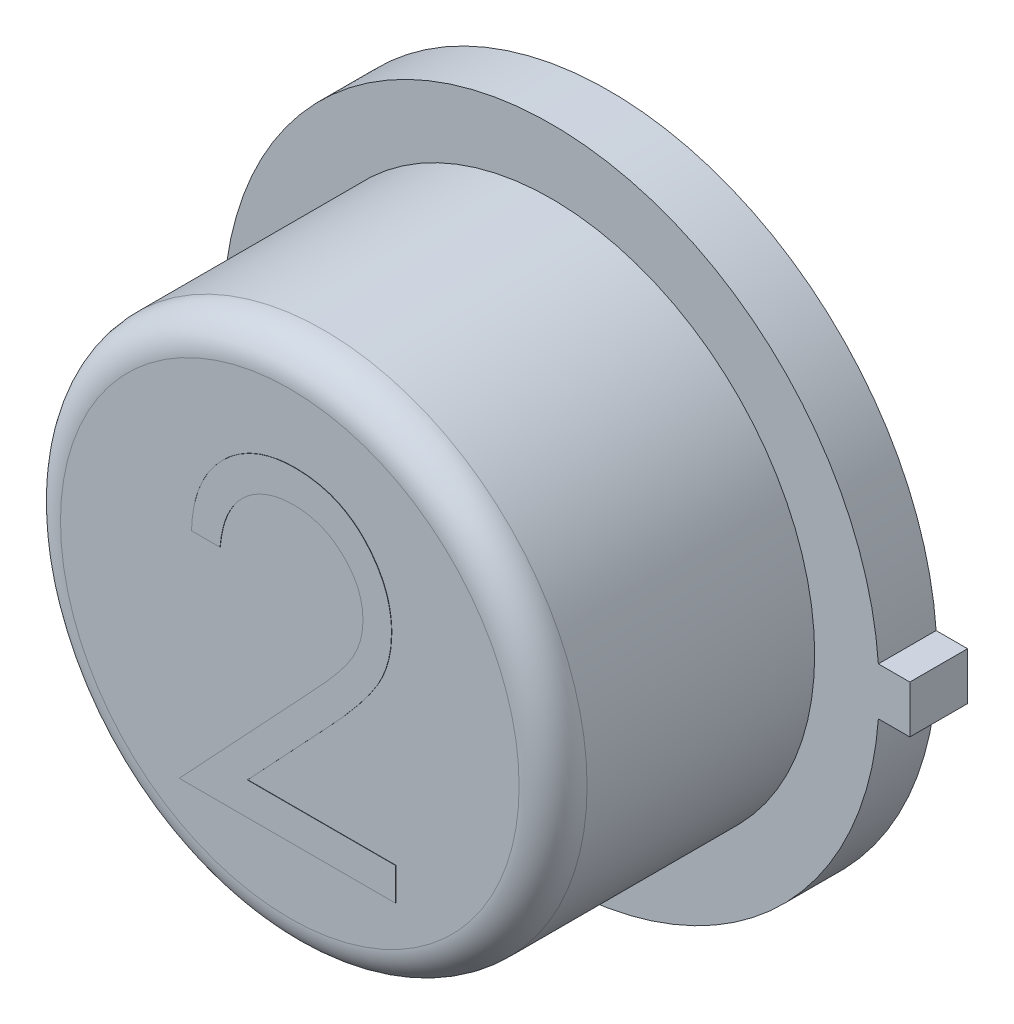
ISO-10303-21;
HEADER;
FILE_DESCRIPTION(('STEP AP214'),'2;1');
FILE_NAME('part.step','',(''),(''),'','','');
FILE_SCHEMA(('AUTOMOTIVE_DESIGN { 1 0 10303 214 1 1 1 1 }'));
ENDSEC;
DATA;
#1=APPLICATION_CONTEXT('core data for automotive mechanical design processes');
#2=APPLICATION_PROTOCOL_DEFINITION('international standard','automotive_design',2000,#1);
#3=PRODUCT_CONTEXT('',#1,'mechanical');
#4=PRODUCT('Part','Part','',(#3));
#5=PRODUCT_RELATED_PRODUCT_CATEGORY('part','',(#4));
#6=PRODUCT_DEFINITION_FORMATION('','',#4);
#7=PRODUCT_DEFINITION_CONTEXT('part definition',#1,'design');
#8=PRODUCT_DEFINITION('design','',#6,#7);
#9=PRODUCT_DEFINITION_SHAPE('','',#8);
#10=(LENGTH_UNIT() NAMED_UNIT(*) SI_UNIT(.MILLI.,.METRE.));
#11=(NAMED_UNIT(*) PLANE_ANGLE_UNIT() SI_UNIT($,.RADIAN.));
#12=(NAMED_UNIT(*) SI_UNIT($,.STERADIAN.) SOLID_ANGLE_UNIT());
#13=UNCERTAINTY_MEASURE_WITH_UNIT(LENGTH_MEASURE(1.E-05),#10,'distance_accuracy_value','');
#14=(GEOMETRIC_REPRESENTATION_CONTEXT(3) GLOBAL_UNCERTAINTY_ASSIGNED_CONTEXT((#13)) GLOBAL_UNIT_ASSIGNED_CONTEXT((#10,
#11,#12)) REPRESENTATION_CONTEXT('',''));
#15=CARTESIAN_POINT('',(0.,0.,0.));
#16=DIRECTION('',(0.,0.,1.));
#17=DIRECTION('',(1.,0.,0.));
#18=AXIS2_PLACEMENT_3D('',#15,#16,#17);
#19=CARTESIAN_POINT('',(-0.00322860507148085,-5.53029106093277,0.));
#20=DIRECTION('',(0.,0.,1.));
#21=DIRECTION('',(1.,0.,0.));
#22=AXIS2_PLACEMENT_3D('',#19,#20,#21);
#23=PLANE('',#22);
#24=DIRECTION('',(1.,0.,0.));
#25=VECTOR('',#24,1.);
#26=CARTESIAN_POINT('',(-0.0032286050714822,0.177799999999999,0.));
#27=LINE('',#26,#25);
#28=CARTESIAN_POINT('',(2.44464278985704,0.177799999999999,0.));
#29=VERTEX_POINT('',#28);
#30=CARTESIAN_POINT('',(2.6797,0.177799999999999,0.));
#31=VERTEX_POINT('',#30);
#32=EDGE_CURVE('E226',#29,#31,#27,.T.);
#33=ORIENTED_EDGE('',*,*,#32,.T.);
#34=DIRECTION('',(0.,-1.,0.));
#35=VECTOR('',#34,1.);
#36=CARTESIAN_POINT('',(2.6797,-5.53029106093277,0.));
#37=LINE('',#36,#35);
#38=CARTESIAN_POINT('',(2.6797,-0.1778,0.));
#39=VERTEX_POINT('',#38);
#40=EDGE_CURVE('E249',#31,#39,#37,.T.);
#41=ORIENTED_EDGE('',*,*,#40,.T.);
#42=DIRECTION('',(-1.,0.,0.));
#43=VECTOR('',#42,1.);
#44=CARTESIAN_POINT('',(-0.00322860507148085,-0.1778,0.));
#45=LINE('',#44,#43);
#46=CARTESIAN_POINT('',(2.44464278985704,-0.1778,0.));
#47=VERTEX_POINT('',#46);
#48=EDGE_CURVE('E238',#39,#47,#45,.T.);
#49=ORIENTED_EDGE('',*,*,#48,.T.);
#50=CARTESIAN_POINT('',(0.,0.,0.));
#51=DIRECTION('',(0.,0.,1.));
#52=DIRECTION('',(1.,0.,0.));
#53=AXIS2_PLACEMENT_3D('',#50,#51,#52);
#54=CIRCLE('',#53,2.4511);
#55=EDGE_CURVE('E234',#29,#47,#54,.T.);
#56=ORIENTED_EDGE('',*,*,#55,.F.);
#57=EDGE_LOOP('',(#33,#41,#49,#56));
#58=FACE_BOUND('',#57,.T.);
#59=CARTESIAN_POINT('',(0.,0.,0.));
#60=DIRECTION('',(0.,0.,1.));
#61=DIRECTION('',(1.,0.,0.));
#62=AXIS2_PLACEMENT_3D('',#59,#60,#61);
#63=CIRCLE('',#62,1.75756648099992);
#64=CARTESIAN_POINT('',(1.75756648099992,0.,0.));
#65=VERTEX_POINT('',#64);
#66=EDGE_CURVE('E258',#65,#65,#63,.F.);
#67=ORIENTED_EDGE('',*,*,#66,.F.);
#68=EDGE_LOOP('',(#67));
#69=FACE_BOUND('',#68,.T.);
#70=ADVANCED_FACE('F33',(#58,#69),#23,.F.);
#71=CARTESIAN_POINT('',(-0.00322860507148085,-5.53029106093277,0.4318));
#72=DIRECTION('',(0.,0.,1.));
#73=DIRECTION('',(1.,0.,0.));
#74=AXIS2_PLACEMENT_3D('',#71,#72,#73);
#75=PLANE('',#74);
#76=DIRECTION('',(1.,0.,0.));
#77=VECTOR('',#76,1.);
#78=CARTESIAN_POINT('',(-0.0032286050714822,0.177799999999999,0.4318));
#79=LINE('',#78,#77);
#80=CARTESIAN_POINT('',(2.44464278985704,0.177799999999999,0.4318));
#81=VERTEX_POINT('',#80);
#82=CARTESIAN_POINT('',(2.6797,0.177799999999999,0.4318));
#83=VERTEX_POINT('',#82);
#84=EDGE_CURVE('E251',#81,#83,#79,.T.);
#85=ORIENTED_EDGE('',*,*,#84,.F.);
#86=CARTESIAN_POINT('',(0.,0.,0.4318));
#87=DIRECTION('',(0.,0.,1.));
#88=DIRECTION('',(1.,0.,0.));
#89=AXIS2_PLACEMENT_3D('',#86,#87,#88);
#90=CIRCLE('',#89,2.4511);
#91=CARTESIAN_POINT('',(2.44464278985704,-0.1778,0.4318));
#92=VERTEX_POINT('',#91);
#93=EDGE_CURVE('E560',#81,#92,#90,.T.);
#94=ORIENTED_EDGE('',*,*,#93,.T.);
#95=DIRECTION('',(-1.,0.,0.));
#96=VECTOR('',#95,1.);
#97=CARTESIAN_POINT('',(-0.00322860507148085,-0.1778,0.4318));
#98=LINE('',#97,#96);
#99=CARTESIAN_POINT('',(2.6797,-0.1778,0.4318));
#100=VERTEX_POINT('',#99);
#101=EDGE_CURVE('E561',#100,#92,#98,.T.);
#102=ORIENTED_EDGE('',*,*,#101,.F.);
#103=DIRECTION('',(0.,-1.,0.));
#104=VECTOR('',#103,1.);
#105=CARTESIAN_POINT('',(2.6797,-5.53029106093277,0.4318));
#106=LINE('',#105,#104);
#107=EDGE_CURVE('E244',#83,#100,#106,.T.);
#108=ORIENTED_EDGE('',*,*,#107,.F.);
#109=EDGE_LOOP('',(#85,#94,#102,#108));
#110=FACE_BOUND('',#109,.T.);
#111=CARTESIAN_POINT('',(0.,0.,0.4318));
#112=DIRECTION('',(0.,0.,1.));
#113=DIRECTION('',(1.,0.,0.));
#114=AXIS2_PLACEMENT_3D('',#111,#112,#113);
#115=CIRCLE('',#114,1.9685);
#116=CARTESIAN_POINT('',(1.9685,0.,0.4318));
#117=VERTEX_POINT('',#116);
#118=EDGE_CURVE('E235',#117,#117,#115,.T.);
#119=ORIENTED_EDGE('',*,*,#118,.F.);
#120=EDGE_LOOP('',(#119));
#121=FACE_BOUND('',#120,.T.);
#122=ADVANCED_FACE('F202',(#110,#121),#75,.T.);
#123=CARTESIAN_POINT('',(-0.0032286050714822,0.177799999999999,0.4318));
#124=DIRECTION('',(0.,1.,0.));
#125=DIRECTION('',(-1.,0.,0.));
#126=AXIS2_PLACEMENT_3D('',#123,#124,#125);
#127=PLANE('',#126);
#128=ORIENTED_EDGE('',*,*,#32,.F.);
#129=DIRECTION('',(0.,0.,-1.));
#130=VECTOR('',#129,1.);
#131=CARTESIAN_POINT('',(2.44464278985704,0.177799999999999,0.4318));
#132=LINE('',#131,#130);
#133=EDGE_CURVE('E228',#81,#29,#132,.T.);
#134=ORIENTED_EDGE('',*,*,#133,.F.);
#135=ORIENTED_EDGE('',*,*,#84,.T.);
#136=DIRECTION('',(0.,0.,-1.));
#137=VECTOR('',#136,1.);
#138=CARTESIAN_POINT('',(2.6797,0.177799999999999,0.4318));
#139=LINE('',#138,#137);
#140=EDGE_CURVE('E230',#83,#31,#139,.T.);
#141=ORIENTED_EDGE('',*,*,#140,.T.);
#142=EDGE_LOOP('',(#128,#134,#135,#141));
#143=FACE_BOUND('',#142,.T.);
#144=ADVANCED_FACE('F205',(#143),#127,.T.);
#145=CARTESIAN_POINT('',(0.,0.,0.4318));
#146=DIRECTION('',(0.,0.,-1.));
#147=DIRECTION('',(-1.,0.,0.));
#148=AXIS2_PLACEMENT_3D('',#145,#146,#147);
#149=CYLINDRICAL_SURFACE('',#148,2.4511);
#150=ORIENTED_EDGE('',*,*,#55,.T.);
#151=DIRECTION('',(0.,0.,-1.));
#152=VECTOR('',#151,1.);
#153=CARTESIAN_POINT('',(2.44464278985704,-0.1778,0.4318));
#154=LINE('',#153,#152);
#155=EDGE_CURVE('E255',#92,#47,#154,.T.);
#156=ORIENTED_EDGE('',*,*,#155,.F.);
#157=ORIENTED_EDGE('',*,*,#93,.F.);
#158=ORIENTED_EDGE('',*,*,#133,.T.);
#159=EDGE_LOOP('',(#150,#156,#157,#158));
#160=FACE_BOUND('',#159,.T.);
#161=ADVANCED_FACE('F216',(#160),#149,.T.);
#162=CARTESIAN_POINT('',(-0.00322860507148085,-0.1778,0.4318));
#163=DIRECTION('',(0.,-1.,0.));
#164=DIRECTION('',(0.,0.,-1.));
#165=AXIS2_PLACEMENT_3D('',#162,#163,#164);
#166=PLANE('',#165);
#167=ORIENTED_EDGE('',*,*,#48,.F.);
#168=DIRECTION('',(0.,0.,-1.));
#169=VECTOR('',#168,1.);
#170=CARTESIAN_POINT('',(2.6797,-0.1778,0.4318));
#171=LINE('',#170,#169);
#172=EDGE_CURVE('E253',#100,#39,#171,.T.);
#173=ORIENTED_EDGE('',*,*,#172,.F.);
#174=ORIENTED_EDGE('',*,*,#101,.T.);
#175=ORIENTED_EDGE('',*,*,#155,.T.);
#176=EDGE_LOOP('',(#167,#173,#174,#175));
#177=FACE_BOUND('',#176,.T.);
#178=ADVANCED_FACE('F212',(#177),#166,.T.);
#179=CARTESIAN_POINT('',(2.6797,-5.53029106093277,0.4318));
#180=DIRECTION('',(1.,0.,0.));
#181=DIRECTION('',(0.,0.,-1.));
#182=AXIS2_PLACEMENT_3D('',#179,#180,#181);
#183=PLANE('',#182);
#184=ORIENTED_EDGE('',*,*,#40,.F.);
#185=ORIENTED_EDGE('',*,*,#140,.F.);
#186=ORIENTED_EDGE('',*,*,#107,.T.);
#187=ORIENTED_EDGE('',*,*,#172,.T.);
#188=EDGE_LOOP('',(#184,#185,#186,#187));
#189=FACE_BOUND('',#188,.T.);
#190=ADVANCED_FACE('F200',(#189),#183,.T.);
#191=CARTESIAN_POINT('',(0.,0.,2.3876));
#192=DIRECTION('',(0.,0.,-1.));
#193=DIRECTION('',(-1.,0.,0.));
#194=AXIS2_PLACEMENT_3D('',#191,#192,#193);
#195=CYLINDRICAL_SURFACE('',#194,1.9685);
#196=CARTESIAN_POINT('',(0.,0.,2.1336));
#197=DIRECTION('',(0.,0.,1.));
#198=DIRECTION('',(1.,0.,0.));
#199=AXIS2_PLACEMENT_3D('',#196,#197,#198);
#200=CIRCLE('',#199,1.9685);
#201=CARTESIAN_POINT('',(1.9685,0.,2.1336));
#202=VERTEX_POINT('',#201);
#203=EDGE_CURVE('E11',#202,#202,#200,.F.);
#204=ORIENTED_EDGE('',*,*,#203,.T.);
#205=EDGE_LOOP('',(#204));
#206=FACE_BOUND('',#205,.T.);
#207=ORIENTED_EDGE('',*,*,#118,.T.);
#208=EDGE_LOOP('',(#207));
#209=FACE_BOUND('',#208,.T.);
#210=ADVANCED_FACE('F197',(#206,#209),#195,.T.);
#211=CARTESIAN_POINT('',(0.,0.,2.3876));
#212=DIRECTION('',(0.,0.,1.));
#213=DIRECTION('',(1.,0.,0.));
#214=AXIS2_PLACEMENT_3D('',#211,#212,#213);
#215=PLANE('',#214);
#216=CARTESIAN_POINT('',(0.0329139122596155,0.979935716155492,2.3876));
#217=CARTESIAN_POINT('',(0.0142919706879015,0.979449238847353,2.3876));
#218=CARTESIAN_POINT('',(-0.0222784478114771,0.978493877738492,2.3876));
#219=CARTESIAN_POINT('',(-0.0759715755772296,0.97181095812963,2.3876));
#220=CARTESIAN_POINT('',(-0.127192792071144,0.960281734573859,2.3876));
#221=CARTESIAN_POINT('',(-0.17607094390161,0.944513318606976,2.3876));
#222=CARTESIAN_POINT('',(-0.222688733534912,0.924470984497503,2.3876));
#223=CARTESIAN_POINT('',(-0.266819449210305,0.89950749392141,2.3876));
#224=CARTESIAN_POINT('',(-0.308364022081785,0.869719081615842,2.3876));
#225=CARTESIAN_POINT('',(-0.3474005495722,0.835945774545375,2.3876));
#226=CARTESIAN_POINT('',(-0.383366935327934,0.798344067289539,2.3876));
#227=CARTESIAN_POINT('',(-0.41496739908603,0.756427288845778,2.3876));
#228=CARTESIAN_POINT('',(-0.442579022994465,0.710960779459374,2.3876));
#229=CARTESIAN_POINT('',(-0.466669947915542,0.662067219161298,2.3876));
#230=CARTESIAN_POINT('',(-0.486234087061141,0.609302950993265,2.3876));
#231=CARTESIAN_POINT('',(-0.501183676908015,0.55285528037316,2.3876));
#232=CARTESIAN_POINT('',(-0.513012942266827,0.49296930478729,2.3876));
#233=CARTESIAN_POINT('',(-0.51696481074977,0.451613738125944,2.3876));
#234=CARTESIAN_POINT('',(-0.518990384615384,0.430416485386261,2.3876));
#235=B_SPLINE_CURVE_WITH_KNOTS('',3,(#216,#217,#218,#219,#220,#221,#222,#223,#224,#225,#226,
#227,#228,#229,#230,#231,#232,#233,#234),.UNSPECIFIED.,.F.,.F.,(4,1,1,1,1,1,1,1,1,1,1,1,1,1,1,1,
4),(0.,0.0644386715952429,0.126546911271678,0.18688715343657,0.245877535589455,
0.304040884691267,0.36219121807266,0.420975932791644,0.480660283279666,0.540600274953758,
0.600689098349454,0.661935789757196,0.724442505913983,0.789038393881744,0.856313757050995,
0.926352028205864,1.),.UNSPECIFIED.);
#236=CARTESIAN_POINT('',(0.0329139122596155,0.979935716155492,2.3876));
#237=VERTEX_POINT('',#236);
#238=CARTESIAN_POINT('',(-0.518990384615384,0.430416485386261,2.3876));
#239=VERTEX_POINT('',#238);
#240=EDGE_CURVE('E476',#237,#239,#235,.T.);
#241=ORIENTED_EDGE('',*,*,#240,.T.);
#242=DIRECTION('',(-1.,0.,0.));
#243=VECTOR('',#242,1.);
#244=CARTESIAN_POINT('',(-0.518990384615384,0.430416485386261,2.3876));
#245=LINE('',#244,#243);
#246=CARTESIAN_POINT('',(-0.732692307692307,0.430416485386261,2.3876));
#247=VERTEX_POINT('',#246);
#248=EDGE_CURVE('E151',#239,#247,#245,.T.);
#249=ORIENTED_EDGE('',*,*,#248,.T.);
#250=CARTESIAN_POINT('',(-0.732692307692307,0.430416485386261,2.3876));
#251=CARTESIAN_POINT('',(-0.731299512520841,0.45876757152828,2.3876));
#252=CARTESIAN_POINT('',(-0.728564099870997,0.51444835019442,2.3876));
#253=CARTESIAN_POINT('',(-0.715754138783993,0.595631222226658,2.3876));
#254=CARTESIAN_POINT('',(-0.697424720542823,0.673229219216252,2.3876));
#255=CARTESIAN_POINT('',(-0.671508927722036,0.746619285684894,2.3876));
#256=CARTESIAN_POINT('',(-0.63932376373939,0.816450331318382,2.3876));
#257=CARTESIAN_POINT('',(-0.60072708439632,0.882444984851201,2.3876));
#258=CARTESIAN_POINT('',(-0.555011268243438,0.944351490030246,2.3876));
#259=CARTESIAN_POINT('',(-0.503163472401816,1.00159595305806,2.3876));
#260=CARTESIAN_POINT('',(-0.44685123761618,1.05411106819117,2.3876));
#261=CARTESIAN_POINT('',(-0.386091303797491,1.09946043874323,2.3876));
#262=CARTESIAN_POINT('',(-0.32224316916163,1.13777656872343,2.3876));
#263=CARTESIAN_POINT('',(-0.255500542365531,1.16980862789286,2.3876));
#264=CARTESIAN_POINT('',(-0.185110408943832,1.19385234449373,2.3876));
#265=CARTESIAN_POINT('',(-0.111711536020924,1.21169242429614,2.3876));
#266=CARTESIAN_POINT('',(-0.0349814449995035,1.222425973796,2.3876));
#267=CARTESIAN_POINT('',(0.0172972128574278,1.22357971364463,2.3876));
#268=CARTESIAN_POINT('',(0.0438852163461539,1.22416648538626,2.3876));
#269=B_SPLINE_CURVE_WITH_KNOTS('',3,(#250,#251,#252,#253,#254,#255,#256,#257,#258,#259,#260,
#261,#262,#263,#264,#265,#266,#267,#268),.UNSPECIFIED.,.F.,.F.,(4,1,1,1,1,1,1,1,1,1,1,1,1,1,1,1,
4),(0.,0.0687907943906179,0.135103289431128,0.198978674310651,0.261904299780856,
0.323494969367969,0.385195377966051,0.446969238740774,0.509764776703132,0.572250568847368,
0.633405175661153,0.693251162921752,0.75258316278567,0.812579266153421,0.873275084920192,
0.935549942895029,1.),.UNSPECIFIED.);
#270=CARTESIAN_POINT('',(0.0438852163461539,1.22416648538626,2.3876));
#271=VERTEX_POINT('',#270);
#272=EDGE_CURVE('E487',#247,#271,#269,.T.);
#273=ORIENTED_EDGE('',*,*,#272,.T.);
#274=CARTESIAN_POINT('',(0.0438852163461539,1.22416648538626,2.3876));
#275=CARTESIAN_POINT('',(0.0699960131805783,1.22355521412607,2.3876));
#276=CARTESIAN_POINT('',(0.121302796241458,1.22235408793536,2.3876));
#277=CARTESIAN_POINT('',(0.196184273931725,1.21203917338033,2.3876));
#278=CARTESIAN_POINT('',(0.267470254629134,1.1958836904999,2.3876));
#279=CARTESIAN_POINT('',(0.335021395780641,1.17321730904389,2.3876));
#280=CARTESIAN_POINT('',(0.398298736140724,1.14274790397861,2.3876));
#281=CARTESIAN_POINT('',(0.457777628954953,1.10614636428441,2.3876));
#282=CARTESIAN_POINT('',(0.514166180582402,1.06381465758299,2.3876));
#283=CARTESIAN_POINT('',(0.564925438718533,1.01397590236185,2.3876));
#284=CARTESIAN_POINT('',(0.611535399770343,0.960770351498978,2.3876));
#285=CARTESIAN_POINT('',(0.651746041216715,0.903968759934283,2.3876));
#286=CARTESIAN_POINT('',(0.686181068508389,0.845302049474601,2.3876));
#287=CARTESIAN_POINT('',(0.71488375785612,0.78432286232718,2.3876));
#288=CARTESIAN_POINT('',(0.736013023812921,0.720457037639259,2.3876));
#289=CARTESIAN_POINT('',(0.752054626061474,0.654634387168514,2.3876));
#290=CARTESIAN_POINT('',(0.76112202715998,0.586173578251548,2.3876));
#291=CARTESIAN_POINT('',(0.762513645646911,0.539836796641207,2.3876));
#292=CARTESIAN_POINT('',(0.763221153846154,0.516278865193954,2.3876));
#293=B_SPLINE_CURVE_WITH_KNOTS('',3,(#274,#275,#276,#277,#278,#279,#280,#281,#282,#283,#284,
#285,#286,#287,#288,#289,#290,#291,#292),.UNSPECIFIED.,.F.,.F.,(4,1,1,1,1,1,1,1,1,1,1,1,1,1,1,1,
4),(0.,0.0694754602496704,0.136516797617799,0.200788823609261,0.263829672855826,
0.32573502296542,0.387290692215291,0.449509218762603,0.512967819545441,0.576275215493061,
0.637580100263924,0.697902605917102,0.757172088426985,0.816598528488655,0.87665317089282,
0.93728964241024,1.),.UNSPECIFIED.);
#294=CARTESIAN_POINT('',(0.763221153846154,0.516278865193954,2.3876));
#295=VERTEX_POINT('',#294);
#296=EDGE_CURVE('E491',#271,#295,#293,.T.);
#297=ORIENTED_EDGE('',*,*,#296,.T.);
#298=CARTESIAN_POINT('',(0.763221153846154,0.516278865193954,2.3876));
#299=CARTESIAN_POINT('',(0.762069130367012,0.483112927742152,2.3876));
#300=CARTESIAN_POINT('',(0.759785299789741,0.417363068084171,2.3876));
#301=CARTESIAN_POINT('',(0.74024926858941,0.320742241820885,2.3876));
#302=CARTESIAN_POINT('',(0.709737624433396,0.22712957633513,2.3876));
#303=CARTESIAN_POINT('',(0.673000137005537,0.151788661881248,2.3876));
#304=CARTESIAN_POINT('',(0.635939420599286,0.0910780170215541,2.3876));
#305=CARTESIAN_POINT('',(0.602542384182895,0.0410930588529433,2.3876));
#306=CARTESIAN_POINT('',(0.563445789541273,-0.0127269116048438,2.3876));
#307=CARTESIAN_POINT('',(0.518080597177372,-0.0702016714967657,2.3876));
#308=CARTESIAN_POINT('',(0.467385232374817,-0.131781412287035,2.3876));
#309=CARTESIAN_POINT('',(0.410900510519678,-0.197428933799167,2.3876));
#310=CARTESIAN_POINT('',(0.348223641501548,-0.266465977194596,2.3876));
#311=CARTESIAN_POINT('',(0.304232768666899,-0.313618538138815,2.3876));
#312=CARTESIAN_POINT('',(0.281437800480769,-0.338051813892585,2.3876));
#313=B_SPLINE_CURVE_WITH_KNOTS('',3,(#298,#299,#300,#301,#302,#303,#304,#305,#306,#307,#308,
#309,#310,#311,#312),.UNSPECIFIED.,.F.,.F.,(4,1,1,1,1,1,1,1,1,1,1,1,4),(0.,0.0987021963061523,
0.195672308810664,0.292422426507954,0.391342543799825,0.444462440671892,0.504228775449316,
0.570352337994678,0.642545753097748,0.722287505344018,0.807921122682712,0.900469537985015,1.),.UNSPECIFIED.);
#314=CARTESIAN_POINT('',(0.281437800480769,-0.338051813892585,2.3876));
#315=VERTEX_POINT('',#314);
#316=EDGE_CURVE('E498',#295,#315,#313,.T.);
#317=ORIENTED_EDGE('',*,*,#316,.T.);
#318=DIRECTION('',(-0.683740795861405,-0.729724964678345,0.));
#319=VECTOR('',#318,1.);
#320=CARTESIAN_POINT('',(0.281437800480769,-0.338051813892585,2.3876));
#321=LINE('',#320,#319);
#322=CARTESIAN_POINT('',(-0.314351712740384,-0.973910437690662,2.3876));
#323=VERTEX_POINT('',#322);
#324=EDGE_CURVE('E505',#315,#323,#321,.T.);
#325=ORIENTED_EDGE('',*,*,#324,.T.);
#326=DIRECTION('',(1.,0.,0.));
#327=VECTOR('',#326,1.);
#328=CARTESIAN_POINT('',(-0.314351712740384,-0.973910437690662,2.3876));
#329=LINE('',#328,#327);
#330=CARTESIAN_POINT('',(0.79375,-0.973910437690662,2.3876));
#331=VERTEX_POINT('',#330);
#332=EDGE_CURVE('E510',#323,#331,#329,.T.);
#333=ORIENTED_EDGE('',*,*,#332,.T.);
#334=DIRECTION('',(0.,-1.,0.));
#335=VECTOR('',#334,1.);
#336=CARTESIAN_POINT('',(0.79375,-0.973910437690662,2.3876));
#337=LINE('',#336,#335);
#338=CARTESIAN_POINT('',(0.79375,-1.21814120692143,2.3876));
#339=VERTEX_POINT('',#338);
#340=EDGE_CURVE('E512',#331,#339,#337,.T.);
#341=ORIENTED_EDGE('',*,*,#340,.T.);
#342=DIRECTION('',(-1.,0.,0.));
#343=VECTOR('',#342,1.);
#344=CARTESIAN_POINT('',(0.79375,-1.21814120692143,2.3876));
#345=LINE('',#344,#343);
#346=CARTESIAN_POINT('',(-0.824278846153846,-1.21814120692143,2.3876));
#347=VERTEX_POINT('',#346);
#348=EDGE_CURVE('E514',#339,#347,#345,.T.);
#349=ORIENTED_EDGE('',*,*,#348,.T.);
#350=DIRECTION('',(0.683776631973393,0.729691385153425,0.));
#351=VECTOR('',#350,1.);
#352=CARTESIAN_POINT('',(-0.824278846153846,-1.21814120692143,2.3876));
#353=LINE('',#352,#351);
#354=CARTESIAN_POINT('',(0.09921875,-0.232631892017585,2.3876));
#355=VERTEX_POINT('',#354);
#356=EDGE_CURVE('E516',#347,#355,#353,.T.);
#357=ORIENTED_EDGE('',*,*,#356,.T.);
#358=CARTESIAN_POINT('',(0.09921875,-0.232631892017585,2.3876));
#359=CARTESIAN_POINT('',(0.121703115846058,-0.209160722740764,2.3876));
#360=CARTESIAN_POINT('',(0.164890981082312,-0.164077410068979,2.3876));
#361=CARTESIAN_POINT('',(0.225975198518571,-0.0982576461206535,2.3876));
#362=CARTESIAN_POINT('',(0.28083851020969,-0.0371959050018006,2.3876));
#363=CARTESIAN_POINT('',(0.329836057791947,0.0189924431363212,2.3876));
#364=CARTESIAN_POINT('',(0.371904924835481,0.0711292776543433,2.3876));
#365=CARTESIAN_POINT('',(0.409237639785665,0.117526031345296,2.3876));
#366=CARTESIAN_POINT('',(0.439149943650253,0.160221469858355,2.3876));
#367=CARTESIAN_POINT('',(0.471613453930615,0.209711066109558,2.3876));
#368=CARTESIAN_POINT('',(0.503055466274764,0.270135160472621,2.3876));
#369=CARTESIAN_POINT('',(0.530074051366534,0.343976831202012,2.3876));
#370=CARTESIAN_POINT('',(0.546548796471756,0.419991265611926,2.3876));
#371=CARTESIAN_POINT('',(0.54852512205697,0.471359615817299,2.3876));
#372=CARTESIAN_POINT('',(0.549519230769231,0.4971983363478,2.3876));
#373=B_SPLINE_CURVE_WITH_KNOTS('',3,(#358,#359,#360,#361,#362,#363,#364,#365,#366,#367,#368,
#369,#370,#371,#372),.UNSPECIFIED.,.F.,.F.,(4,1,1,1,1,1,1,1,1,1,1,1,4),(0.,0.110802643801319,
0.21282920234777,0.306101309823111,0.39064732111601,0.466924469360852,0.534481039284031,
0.593586940965673,0.644557004508718,0.736200452629373,0.825024025618864,0.911985584829758,1.),.UNSPECIFIED.);
#374=CARTESIAN_POINT('',(0.549519230769231,0.4971983363478,2.3876));
#375=VERTEX_POINT('',#374);
#376=EDGE_CURVE('E53',#355,#375,#373,.T.);
#377=ORIENTED_EDGE('',*,*,#376,.T.);
#378=CARTESIAN_POINT('',(0.549519230769231,0.4971983363478,2.3876));
#379=CARTESIAN_POINT('',(0.549086698954805,0.513446216338012,2.3876));
#380=CARTESIAN_POINT('',(0.548234261806957,0.545467667744543,2.3876));
#381=CARTESIAN_POINT('',(0.540711078333494,0.59241622879114,2.3876));
#382=CARTESIAN_POINT('',(0.529341966151339,0.637704075333669,2.3876));
#383=CARTESIAN_POINT('',(0.513050638800869,0.681470510840625,2.3876));
#384=CARTESIAN_POINT('',(0.491546767421379,0.723275499121363,2.3876));
#385=CARTESIAN_POINT('',(0.465371128584585,0.763169927617028,2.3876));
#386=CARTESIAN_POINT('',(0.435170031866359,0.801738670012082,2.3876));
#387=CARTESIAN_POINT('',(0.400232828982323,0.837901896012309,2.3876));
#388=CARTESIAN_POINT('',(0.361852848542487,0.871022501885198,2.3876));
#389=CARTESIAN_POINT('',(0.321307475163964,0.900362281426045,2.3876));
#390=CARTESIAN_POINT('',(0.278410886372846,0.924881747880242,2.3876));
#391=CARTESIAN_POINT('',(0.233343946106796,0.944981877211926,2.3876));
#392=CARTESIAN_POINT('',(0.186232296384326,0.960749413347293,2.3876));
#393=CARTESIAN_POINT('',(0.136984818006412,0.971674982561943,2.3876));
#394=CARTESIAN_POINT('',(0.0857375854999246,0.978534672532779,2.3876));
#395=CARTESIAN_POINT('',(0.0507444393246856,0.979462796634722,2.3876));
#396=CARTESIAN_POINT('',(0.0329139122596155,0.979935716155492,2.3876));
#397=B_SPLINE_CURVE_WITH_KNOTS('',3,(#378,#379,#380,#381,#382,#383,#384,#385,#386,#387,#388,
#389,#390,#391,#392,#393,#394,#395,#396),.UNSPECIFIED.,.F.,.F.,(4,1,1,1,1,1,1,1,1,1,1,1,1,1,1,1,
4),(0.,0.0619654006870624,0.122121905638296,0.180988496849842,0.239933216451903,
0.299905831106524,0.359988847476988,0.421775741741646,0.486575826421127,0.551534804619741,
0.61501754275998,0.677258616661657,0.739729962362713,0.803050102662951,0.866495132015698,
0.931973474177149,1.),.UNSPECIFIED.);
#398=EDGE_CURVE('E48',#375,#237,#397,.T.);
#399=ORIENTED_EDGE('',*,*,#398,.T.);
#400=EDGE_LOOP('',(#241,#249,#273,#297,#317,#325,#333,#341,#349,#357,#377,#399));
#401=FACE_BOUND('',#400,.T.);
#402=CARTESIAN_POINT('',(0.,0.,2.3876));
#403=DIRECTION('',(0.,0.,1.));
#404=DIRECTION('',(1.,0.,0.));
#405=AXIS2_PLACEMENT_3D('',#402,#403,#404);
#406=CIRCLE('',#405,1.7145);
#407=CARTESIAN_POINT('',(1.7145,0.,2.3876));
#408=VERTEX_POINT('',#407);
#409=EDGE_CURVE('E41',#408,#408,#406,.T.);
#410=ORIENTED_EDGE('',*,*,#409,.T.);
#411=EDGE_LOOP('',(#410));
#412=FACE_BOUND('',#411,.T.);
#413=ADVANCED_FACE('F193',(#401,#412),#215,.T.);
#414=CARTESIAN_POINT('',(0.,0.,-0.00254));
#415=DIRECTION('',(0.,0.,1.));
#416=DIRECTION('',(1.,0.,0.));
#417=AXIS2_PLACEMENT_3D('',#414,#415,#416);
#418=CYLINDRICAL_SURFACE('',#417,1.75756648099992);
#419=CARTESIAN_POINT('',(0.,0.,-0.00254));
#420=DIRECTION('',(0.,0.,-1.));
#421=DIRECTION('',(-1.,0.,0.));
#422=AXIS2_PLACEMENT_3D('',#419,#420,#421);
#423=CIRCLE('',#422,1.75756648099992);
#424=CARTESIAN_POINT('',(-1.75756648099992,0.,-0.00254));
#425=VERTEX_POINT('',#424);
#426=EDGE_CURVE('E241',#425,#425,#423,.T.);
#427=ORIENTED_EDGE('',*,*,#426,.F.);
#428=EDGE_LOOP('',(#427));
#429=FACE_BOUND('',#428,.T.);
#430=ORIENTED_EDGE('',*,*,#66,.T.);
#431=EDGE_LOOP('',(#430));
#432=FACE_BOUND('',#431,.T.);
#433=ADVANCED_FACE('F189',(#429,#432),#418,.T.);
#434=CARTESIAN_POINT('',(0.,0.,-0.00254));
#435=DIRECTION('',(0.,0.,-1.));
#436=DIRECTION('',(-1.,0.,0.));
#437=AXIS2_PLACEMENT_3D('',#434,#435,#436);
#438=PLANE('',#437);
#439=ORIENTED_EDGE('',*,*,#426,.T.);
#440=EDGE_LOOP('',(#439));
#441=FACE_BOUND('',#440,.T.);
#442=ADVANCED_FACE('F186',(#441),#438,.T.);
#443=CARTESIAN_POINT('',(0.,0.,2.1336));
#444=DIRECTION('',(0.,0.,1.));
#445=DIRECTION('',(1.,0.,0.));
#446=AXIS2_PLACEMENT_3D('',#443,#444,#445);
#447=TOROIDAL_SURFACE('',#446,1.7145,0.254);
#448=ORIENTED_EDGE('',*,*,#203,.F.);
#449=EDGE_LOOP('',(#448));
#450=FACE_BOUND('',#449,.T.);
#451=ORIENTED_EDGE('',*,*,#409,.F.);
#452=EDGE_LOOP('',(#451));
#453=FACE_BOUND('',#452,.T.);
#454=ADVANCED_FACE('F35',(#450,#453),#447,.T.);
#455=CARTESIAN_POINT('',(0.0329139122596155,0.979935716155492,2.39014));
#456=CARTESIAN_POINT('',(0.0142919706879015,0.979449238847353,2.39014));
#457=CARTESIAN_POINT('',(-0.0222784478114771,0.978493877738492,2.39014));
#458=CARTESIAN_POINT('',(-0.0759715755772296,0.97181095812963,2.39014));
#459=CARTESIAN_POINT('',(-0.127192792071144,0.960281734573859,2.39014));
#460=CARTESIAN_POINT('',(-0.17607094390161,0.944513318606976,2.39014));
#461=CARTESIAN_POINT('',(-0.222688733534912,0.924470984497503,2.39014));
#462=CARTESIAN_POINT('',(-0.266819449210305,0.89950749392141,2.39014));
#463=CARTESIAN_POINT('',(-0.308364022081785,0.869719081615842,2.39014));
#464=CARTESIAN_POINT('',(-0.3474005495722,0.835945774545375,2.39014));
#465=CARTESIAN_POINT('',(-0.383366935327934,0.798344067289539,2.39014));
#466=CARTESIAN_POINT('',(-0.41496739908603,0.756427288845778,2.39014));
#467=CARTESIAN_POINT('',(-0.442579022994465,0.710960779459374,2.39014));
#468=CARTESIAN_POINT('',(-0.466669947915542,0.662067219161298,2.39014));
#469=CARTESIAN_POINT('',(-0.486234087061141,0.609302950993265,2.39014));
#470=CARTESIAN_POINT('',(-0.501183676908015,0.55285528037316,2.39014));
#471=CARTESIAN_POINT('',(-0.513012942266827,0.49296930478729,2.39014));
#472=CARTESIAN_POINT('',(-0.51696481074977,0.451613738125944,2.39014));
#473=CARTESIAN_POINT('',(-0.518990384615384,0.430416485386261,2.39014));
#474=B_SPLINE_CURVE_WITH_KNOTS('',3,(#455,#456,#457,#458,#459,#460,#461,#462,#463,#464,#465,
#466,#467,#468,#469,#470,#471,#472,#473),.UNSPECIFIED.,.F.,.F.,(4,1,1,1,1,1,1,1,1,1,1,1,1,1,1,1,
4),(0.,0.0644386715952429,0.126546911271678,0.18688715343657,0.245877535589455,
0.304040884691267,0.36219121807266,0.420975932791644,0.480660283279666,0.540600274953758,
0.600689098349454,0.661935789757196,0.724442505913983,0.789038393881744,0.856313757050995,
0.926352028205864,1.),.UNSPECIFIED.);
#475=DIRECTION('',(0.,0.,-1.));
#476=VECTOR('',#475,1.);
#477=SURFACE_OF_LINEAR_EXTRUSION('',#474,#476);
#478=ORIENTED_EDGE('',*,*,#240,.F.);
#479=DIRECTION('',(0.,0.,-1.));
#480=VECTOR('',#479,1.);
#481=CARTESIAN_POINT('',(0.0329139122596155,0.979935716155492,2.39014));
#482=LINE('',#481,#480);
#483=CARTESIAN_POINT('',(0.0329139122596155,0.979935716155492,2.39014));
#484=VERTEX_POINT('',#483);
#485=EDGE_CURVE('E170',#484,#237,#482,.T.);
#486=ORIENTED_EDGE('',*,*,#485,.F.);
#487=CARTESIAN_POINT('',(-0.518990384615384,0.430416485386261,2.39014));
#488=VERTEX_POINT('',#487);
#489=EDGE_CURVE('E163',#484,#488,#474,.T.);
#490=ORIENTED_EDGE('',*,*,#489,.T.);
#491=DIRECTION('',(0.,0.,-1.));
#492=VECTOR('',#491,1.);
#493=CARTESIAN_POINT('',(-0.518990384615384,0.430416485386261,2.39014));
#494=LINE('',#493,#492);
#495=EDGE_CURVE('E146',#488,#239,#494,.T.);
#496=ORIENTED_EDGE('',*,*,#495,.T.);
#497=EDGE_LOOP('',(#478,#486,#490,#496));
#498=FACE_BOUND('',#497,.T.);
#499=ADVANCED_FACE('F169',(#498),#477,.T.);
#500=CARTESIAN_POINT('',(0.549519230769231,0.4971983363478,2.39014));
#501=CARTESIAN_POINT('',(0.549086698954805,0.513446216338012,2.39014));
#502=CARTESIAN_POINT('',(0.548234261806957,0.545467667744543,2.39014));
#503=CARTESIAN_POINT('',(0.540711078333494,0.59241622879114,2.39014));
#504=CARTESIAN_POINT('',(0.529341966151339,0.637704075333669,2.39014));
#505=CARTESIAN_POINT('',(0.513050638800869,0.681470510840625,2.39014));
#506=CARTESIAN_POINT('',(0.491546767421379,0.723275499121363,2.39014));
#507=CARTESIAN_POINT('',(0.465371128584585,0.763169927617028,2.39014));
#508=CARTESIAN_POINT('',(0.435170031866359,0.801738670012082,2.39014));
#509=CARTESIAN_POINT('',(0.400232828982323,0.837901896012309,2.39014));
#510=CARTESIAN_POINT('',(0.361852848542487,0.871022501885198,2.39014));
#511=CARTESIAN_POINT('',(0.321307475163964,0.900362281426045,2.39014));
#512=CARTESIAN_POINT('',(0.278410886372846,0.924881747880242,2.39014));
#513=CARTESIAN_POINT('',(0.233343946106796,0.944981877211926,2.39014));
#514=CARTESIAN_POINT('',(0.186232296384326,0.960749413347293,2.39014));
#515=CARTESIAN_POINT('',(0.136984818006412,0.971674982561943,2.39014));
#516=CARTESIAN_POINT('',(0.0857375854999246,0.978534672532779,2.39014));
#517=CARTESIAN_POINT('',(0.0507444393246856,0.979462796634722,2.39014));
#518=CARTESIAN_POINT('',(0.0329139122596155,0.979935716155492,2.39014));
#519=B_SPLINE_CURVE_WITH_KNOTS('',3,(#500,#501,#502,#503,#504,#505,#506,#507,#508,#509,#510,
#511,#512,#513,#514,#515,#516,#517,#518),.UNSPECIFIED.,.F.,.F.,(4,1,1,1,1,1,1,1,1,1,1,1,1,1,1,1,
4),(0.,0.0619654006870624,0.122121905638296,0.180988496849842,0.239933216451903,
0.299905831106524,0.359988847476988,0.421775741741646,0.486575826421127,0.551534804619741,
0.61501754275998,0.677258616661657,0.739729962362713,0.803050102662951,0.866495132015698,
0.931973474177149,1.),.UNSPECIFIED.);
#520=DIRECTION('',(0.,0.,-1.));
#521=VECTOR('',#520,1.);
#522=SURFACE_OF_LINEAR_EXTRUSION('',#519,#521);
#523=ORIENTED_EDGE('',*,*,#398,.F.);
#524=DIRECTION('',(0.,0.,-1.));
#525=VECTOR('',#524,1.);
#526=CARTESIAN_POINT('',(0.549519230769231,0.4971983363478,2.39014));
#527=LINE('',#526,#525);
#528=CARTESIAN_POINT('',(0.549519230769231,0.4971983363478,2.39014));
#529=VERTEX_POINT('',#528);
#530=EDGE_CURVE('E530',#529,#375,#527,.T.);
#531=ORIENTED_EDGE('',*,*,#530,.F.);
#532=EDGE_CURVE('E156',#529,#484,#519,.T.);
#533=ORIENTED_EDGE('',*,*,#532,.T.);
#534=ORIENTED_EDGE('',*,*,#485,.T.);
#535=EDGE_LOOP('',(#523,#531,#533,#534));
#536=FACE_BOUND('',#535,.T.);
#537=ADVANCED_FACE('F184',(#536),#522,.T.);
#538=CARTESIAN_POINT('',(0.09921875,-0.232631892017585,2.39014));
#539=CARTESIAN_POINT('',(0.121703115846058,-0.209160722740764,2.39014));
#540=CARTESIAN_POINT('',(0.164890981082312,-0.164077410068979,2.39014));
#541=CARTESIAN_POINT('',(0.225975198518571,-0.0982576461206535,2.39014));
#542=CARTESIAN_POINT('',(0.28083851020969,-0.0371959050018006,2.39014));
#543=CARTESIAN_POINT('',(0.329836057791947,0.0189924431363212,2.39014));
#544=CARTESIAN_POINT('',(0.371904924835481,0.0711292776543433,2.39014));
#545=CARTESIAN_POINT('',(0.409237639785665,0.117526031345296,2.39014));
#546=CARTESIAN_POINT('',(0.439149943650253,0.160221469858355,2.39014));
#547=CARTESIAN_POINT('',(0.471613453930615,0.209711066109558,2.39014));
#548=CARTESIAN_POINT('',(0.503055466274764,0.270135160472621,2.39014));
#549=CARTESIAN_POINT('',(0.530074051366534,0.343976831202012,2.39014));
#550=CARTESIAN_POINT('',(0.546548796471756,0.419991265611926,2.39014));
#551=CARTESIAN_POINT('',(0.54852512205697,0.471359615817299,2.39014));
#552=CARTESIAN_POINT('',(0.549519230769231,0.4971983363478,2.39014));
#553=B_SPLINE_CURVE_WITH_KNOTS('',3,(#538,#539,#540,#541,#542,#543,#544,#545,#546,#547,#548,
#549,#550,#551,#552),.UNSPECIFIED.,.F.,.F.,(4,1,1,1,1,1,1,1,1,1,1,1,4),(0.,0.110802643801319,
0.21282920234777,0.306101309823111,0.39064732111601,0.466924469360852,0.534481039284031,
0.593586940965673,0.644557004508718,0.736200452629373,0.825024025618864,0.911985584829758,1.),.UNSPECIFIED.);
#554=DIRECTION('',(0.,0.,-1.));
#555=VECTOR('',#554,1.);
#556=SURFACE_OF_LINEAR_EXTRUSION('',#553,#555);
#557=ORIENTED_EDGE('',*,*,#376,.F.);
#558=DIRECTION('',(0.,0.,-1.));
#559=VECTOR('',#558,1.);
#560=CARTESIAN_POINT('',(0.09921875,-0.232631892017585,2.39014));
#561=LINE('',#560,#559);
#562=CARTESIAN_POINT('',(0.09921875,-0.232631892017585,2.39014));
#563=VERTEX_POINT('',#562);
#564=EDGE_CURVE('E532',#563,#355,#561,.T.);
#565=ORIENTED_EDGE('',*,*,#564,.F.);
#566=EDGE_CURVE('E471',#563,#529,#553,.T.);
#567=ORIENTED_EDGE('',*,*,#566,.T.);
#568=ORIENTED_EDGE('',*,*,#530,.T.);
#569=EDGE_LOOP('',(#557,#565,#567,#568));
#570=FACE_BOUND('',#569,.T.);
#571=ADVANCED_FACE('F286',(#570),#556,.T.);
#572=CARTESIAN_POINT('',(-0.824278846153846,-1.21814120692143,2.39014));
#573=DIRECTION('',(-0.729691385153425,0.683776631973393,0.));
#574=DIRECTION('',(-0.683776631973393,-0.729691385153425,0.));
#575=AXIS2_PLACEMENT_3D('',#572,#573,#574);
#576=PLANE('',#575);
#577=ORIENTED_EDGE('',*,*,#356,.F.);
#578=DIRECTION('',(0.,0.,-1.));
#579=VECTOR('',#578,1.);
#580=CARTESIAN_POINT('',(-0.824278846153846,-1.21814120692143,2.39014));
#581=LINE('',#580,#579);
#582=CARTESIAN_POINT('',(-0.824278846153846,-1.21814120692143,2.39014));
#583=VERTEX_POINT('',#582);
#584=EDGE_CURVE('E535',#583,#347,#581,.T.);
#585=ORIENTED_EDGE('',*,*,#584,.F.);
#586=DIRECTION('',(0.683776631973393,0.729691385153425,0.));
#587=VECTOR('',#586,1.);
#588=CARTESIAN_POINT('',(-0.824278846153846,-1.21814120692143,2.39014));
#589=LINE('',#588,#587);
#590=EDGE_CURVE('E598',#583,#563,#589,.T.);
#591=ORIENTED_EDGE('',*,*,#590,.T.);
#592=ORIENTED_EDGE('',*,*,#564,.T.);
#593=EDGE_LOOP('',(#577,#585,#591,#592));
#594=FACE_BOUND('',#593,.T.);
#595=ADVANCED_FACE('F294',(#594),#576,.T.);
#596=CARTESIAN_POINT('',(0.79375,-1.21814120692143,2.39014));
#597=DIRECTION('',(0.,-1.,0.));
#598=DIRECTION('',(0.,0.,-1.));
#599=AXIS2_PLACEMENT_3D('',#596,#597,#598);
#600=PLANE('',#599);
#601=ORIENTED_EDGE('',*,*,#348,.F.);
#602=DIRECTION('',(0.,0.,-1.));
#603=VECTOR('',#602,1.);
#604=CARTESIAN_POINT('',(0.79375,-1.21814120692143,2.39014));
#605=LINE('',#604,#603);
#606=CARTESIAN_POINT('',(0.79375,-1.21814120692143,2.39014));
#607=VERTEX_POINT('',#606);
#608=EDGE_CURVE('E538',#607,#339,#605,.T.);
#609=ORIENTED_EDGE('',*,*,#608,.F.);
#610=DIRECTION('',(-1.,0.,0.));
#611=VECTOR('',#610,1.);
#612=CARTESIAN_POINT('',(0.79375,-1.21814120692143,2.39014));
#613=LINE('',#612,#611);
#614=EDGE_CURVE('E601',#607,#583,#613,.T.);
#615=ORIENTED_EDGE('',*,*,#614,.T.);
#616=ORIENTED_EDGE('',*,*,#584,.T.);
#617=EDGE_LOOP('',(#601,#609,#615,#616));
#618=FACE_BOUND('',#617,.T.);
#619=ADVANCED_FACE('F302',(#618),#600,.T.);
#620=CARTESIAN_POINT('',(0.79375,-0.973910437690662,2.39014));
#621=DIRECTION('',(1.,0.,0.));
#622=DIRECTION('',(0.,0.,-1.));
#623=AXIS2_PLACEMENT_3D('',#620,#621,#622);
#624=PLANE('',#623);
#625=ORIENTED_EDGE('',*,*,#340,.F.);
#626=DIRECTION('',(0.,0.,-1.));
#627=VECTOR('',#626,1.);
#628=CARTESIAN_POINT('',(0.79375,-0.973910437690662,2.39014));
#629=LINE('',#628,#627);
#630=CARTESIAN_POINT('',(0.79375,-0.973910437690662,2.39014));
#631=VERTEX_POINT('',#630);
#632=EDGE_CURVE('E541',#631,#331,#629,.T.);
#633=ORIENTED_EDGE('',*,*,#632,.F.);
#634=DIRECTION('',(0.,-1.,0.));
#635=VECTOR('',#634,1.);
#636=CARTESIAN_POINT('',(0.79375,-0.973910437690662,2.39014));
#637=LINE('',#636,#635);
#638=EDGE_CURVE('E592',#631,#607,#637,.T.);
#639=ORIENTED_EDGE('',*,*,#638,.T.);
#640=ORIENTED_EDGE('',*,*,#608,.T.);
#641=EDGE_LOOP('',(#625,#633,#639,#640));
#642=FACE_BOUND('',#641,.T.);
#643=ADVANCED_FACE('F310',(#642),#624,.T.);
#644=CARTESIAN_POINT('',(-0.314351712740384,-0.973910437690662,2.39014));
#645=DIRECTION('',(0.,1.,0.));
#646=DIRECTION('',(0.,0.,1.));
#647=AXIS2_PLACEMENT_3D('',#644,#645,#646);
#648=PLANE('',#647);
#649=ORIENTED_EDGE('',*,*,#332,.F.);
#650=DIRECTION('',(0.,0.,-1.));
#651=VECTOR('',#650,1.);
#652=CARTESIAN_POINT('',(-0.314351712740384,-0.973910437690662,2.39014));
#653=LINE('',#652,#651);
#654=CARTESIAN_POINT('',(-0.314351712740384,-0.973910437690662,2.39014));
#655=VERTEX_POINT('',#654);
#656=EDGE_CURVE('E544',#655,#323,#653,.T.);
#657=ORIENTED_EDGE('',*,*,#656,.F.);
#658=DIRECTION('',(1.,0.,0.));
#659=VECTOR('',#658,1.);
#660=CARTESIAN_POINT('',(-0.314351712740384,-0.973910437690662,2.39014));
#661=LINE('',#660,#659);
#662=EDGE_CURVE('E588',#655,#631,#661,.T.);
#663=ORIENTED_EDGE('',*,*,#662,.T.);
#664=ORIENTED_EDGE('',*,*,#632,.T.);
#665=EDGE_LOOP('',(#649,#657,#663,#664));
#666=FACE_BOUND('',#665,.T.);
#667=ADVANCED_FACE('F318',(#666),#648,.T.);
#668=CARTESIAN_POINT('',(0.281437800480769,-0.338051813892585,2.39014));
#669=DIRECTION('',(0.729724964678345,-0.683740795861405,0.));
#670=DIRECTION('',(0.683740795861405,0.729724964678345,0.));
#671=AXIS2_PLACEMENT_3D('',#668,#669,#670);
#672=PLANE('',#671);
#673=ORIENTED_EDGE('',*,*,#324,.F.);
#674=DIRECTION('',(0.,0.,-1.));
#675=VECTOR('',#674,1.);
#676=CARTESIAN_POINT('',(0.281437800480769,-0.338051813892585,2.39014));
#677=LINE('',#676,#675);
#678=CARTESIAN_POINT('',(0.281437800480769,-0.338051813892585,2.39014));
#679=VERTEX_POINT('',#678);
#680=EDGE_CURVE('E547',#679,#315,#677,.T.);
#681=ORIENTED_EDGE('',*,*,#680,.F.);
#682=DIRECTION('',(-0.683740795861405,-0.729724964678345,0.));
#683=VECTOR('',#682,1.);
#684=CARTESIAN_POINT('',(0.281437800480769,-0.338051813892585,2.39014));
#685=LINE('',#684,#683);
#686=EDGE_CURVE('E606',#679,#655,#685,.T.);
#687=ORIENTED_EDGE('',*,*,#686,.T.);
#688=ORIENTED_EDGE('',*,*,#656,.T.);
#689=EDGE_LOOP('',(#673,#681,#687,#688));
#690=FACE_BOUND('',#689,.T.);
#691=ADVANCED_FACE('F326',(#690),#672,.T.);
#692=CARTESIAN_POINT('',(0.763221153846154,0.516278865193954,2.39014));
#693=CARTESIAN_POINT('',(0.762069130367012,0.483112927742152,2.39014));
#694=CARTESIAN_POINT('',(0.759785299789741,0.417363068084171,2.39014));
#695=CARTESIAN_POINT('',(0.74024926858941,0.320742241820885,2.39014));
#696=CARTESIAN_POINT('',(0.709737624433396,0.22712957633513,2.39014));
#697=CARTESIAN_POINT('',(0.673000137005537,0.151788661881248,2.39014));
#698=CARTESIAN_POINT('',(0.635939420599286,0.0910780170215541,2.39014));
#699=CARTESIAN_POINT('',(0.602542384182895,0.0410930588529433,2.39014));
#700=CARTESIAN_POINT('',(0.563445789541273,-0.0127269116048438,2.39014));
#701=CARTESIAN_POINT('',(0.518080597177372,-0.0702016714967657,2.39014));
#702=CARTESIAN_POINT('',(0.467385232374817,-0.131781412287035,2.39014));
#703=CARTESIAN_POINT('',(0.410900510519678,-0.197428933799167,2.39014));
#704=CARTESIAN_POINT('',(0.348223641501548,-0.266465977194596,2.39014));
#705=CARTESIAN_POINT('',(0.304232768666899,-0.313618538138815,2.39014));
#706=CARTESIAN_POINT('',(0.281437800480769,-0.338051813892585,2.39014));
#707=B_SPLINE_CURVE_WITH_KNOTS('',3,(#692,#693,#694,#695,#696,#697,#698,#699,#700,#701,#702,
#703,#704,#705,#706),.UNSPECIFIED.,.F.,.F.,(4,1,1,1,1,1,1,1,1,1,1,1,4),(0.,0.0987021963061523,
0.195672308810664,0.292422426507954,0.391342543799825,0.444462440671892,0.504228775449316,
0.570352337994678,0.642545753097748,0.722287505344018,0.807921122682712,0.900469537985015,1.),.UNSPECIFIED.);
#708=DIRECTION('',(0.,0.,-1.));
#709=VECTOR('',#708,1.);
#710=SURFACE_OF_LINEAR_EXTRUSION('',#707,#709);
#711=ORIENTED_EDGE('',*,*,#316,.F.);
#712=DIRECTION('',(0.,0.,-1.));
#713=VECTOR('',#712,1.);
#714=CARTESIAN_POINT('',(0.763221153846154,0.516278865193954,2.39014));
#715=LINE('',#714,#713);
#716=CARTESIAN_POINT('',(0.763221153846154,0.516278865193954,2.39014));
#717=VERTEX_POINT('',#716);
#718=EDGE_CURVE('E550',#717,#295,#715,.T.);
#719=ORIENTED_EDGE('',*,*,#718,.F.);
#720=EDGE_CURVE('E581',#717,#679,#707,.T.);
#721=ORIENTED_EDGE('',*,*,#720,.T.);
#722=ORIENTED_EDGE('',*,*,#680,.T.);
#723=EDGE_LOOP('',(#711,#719,#721,#722));
#724=FACE_BOUND('',#723,.T.);
#725=ADVANCED_FACE('F334',(#724),#710,.T.);
#726=CARTESIAN_POINT('',(0.0438852163461539,1.22416648538626,2.39014));
#727=CARTESIAN_POINT('',(0.0699960131805783,1.22355521412607,2.39014));
#728=CARTESIAN_POINT('',(0.121302796241458,1.22235408793536,2.39014));
#729=CARTESIAN_POINT('',(0.196184273931725,1.21203917338033,2.39014));
#730=CARTESIAN_POINT('',(0.267470254629134,1.1958836904999,2.39014));
#731=CARTESIAN_POINT('',(0.335021395780641,1.17321730904389,2.39014));
#732=CARTESIAN_POINT('',(0.398298736140724,1.14274790397861,2.39014));
#733=CARTESIAN_POINT('',(0.457777628954953,1.10614636428441,2.39014));
#734=CARTESIAN_POINT('',(0.514166180582402,1.06381465758299,2.39014));
#735=CARTESIAN_POINT('',(0.564925438718533,1.01397590236185,2.39014));
#736=CARTESIAN_POINT('',(0.611535399770343,0.960770351498978,2.39014));
#737=CARTESIAN_POINT('',(0.651746041216715,0.903968759934283,2.39014));
#738=CARTESIAN_POINT('',(0.686181068508389,0.845302049474601,2.39014));
#739=CARTESIAN_POINT('',(0.71488375785612,0.78432286232718,2.39014));
#740=CARTESIAN_POINT('',(0.736013023812921,0.720457037639259,2.39014));
#741=CARTESIAN_POINT('',(0.752054626061474,0.654634387168514,2.39014));
#742=CARTESIAN_POINT('',(0.76112202715998,0.586173578251548,2.39014));
#743=CARTESIAN_POINT('',(0.762513645646911,0.539836796641207,2.39014));
#744=CARTESIAN_POINT('',(0.763221153846154,0.516278865193954,2.39014));
#745=B_SPLINE_CURVE_WITH_KNOTS('',3,(#726,#727,#728,#729,#730,#731,#732,#733,#734,#735,#736,
#737,#738,#739,#740,#741,#742,#743,#744),.UNSPECIFIED.,.F.,.F.,(4,1,1,1,1,1,1,1,1,1,1,1,1,1,1,1,
4),(0.,0.0694754602496704,0.136516797617799,0.200788823609261,0.263829672855826,
0.32573502296542,0.387290692215291,0.449509218762603,0.512967819545441,0.576275215493061,
0.637580100263924,0.697902605917102,0.757172088426985,0.816598528488655,0.87665317089282,
0.93728964241024,1.),.UNSPECIFIED.);
#746=DIRECTION('',(0.,0.,-1.));
#747=VECTOR('',#746,1.);
#748=SURFACE_OF_LINEAR_EXTRUSION('',#745,#747);
#749=ORIENTED_EDGE('',*,*,#296,.F.);
#750=DIRECTION('',(0.,0.,-1.));
#751=VECTOR('',#750,1.);
#752=CARTESIAN_POINT('',(0.0438852163461539,1.22416648538626,2.39014));
#753=LINE('',#752,#751);
#754=CARTESIAN_POINT('',(0.0438852163461539,1.22416648538626,2.39014));
#755=VERTEX_POINT('',#754);
#756=EDGE_CURVE('E553',#755,#271,#753,.T.);
#757=ORIENTED_EDGE('',*,*,#756,.F.);
#758=EDGE_CURVE('E577',#755,#717,#745,.T.);
#759=ORIENTED_EDGE('',*,*,#758,.T.);
#760=ORIENTED_EDGE('',*,*,#718,.T.);
#761=EDGE_LOOP('',(#749,#757,#759,#760));
#762=FACE_BOUND('',#761,.T.);
#763=ADVANCED_FACE('F342',(#762),#748,.T.);
#764=CARTESIAN_POINT('',(-0.732692307692307,0.430416485386261,2.39014));
#765=CARTESIAN_POINT('',(-0.731299512520841,0.45876757152828,2.39014));
#766=CARTESIAN_POINT('',(-0.728564099870997,0.51444835019442,2.39014));
#767=CARTESIAN_POINT('',(-0.715754138783993,0.595631222226658,2.39014));
#768=CARTESIAN_POINT('',(-0.697424720542823,0.673229219216252,2.39014));
#769=CARTESIAN_POINT('',(-0.671508927722036,0.746619285684894,2.39014));
#770=CARTESIAN_POINT('',(-0.63932376373939,0.816450331318382,2.39014));
#771=CARTESIAN_POINT('',(-0.60072708439632,0.882444984851201,2.39014));
#772=CARTESIAN_POINT('',(-0.555011268243438,0.944351490030246,2.39014));
#773=CARTESIAN_POINT('',(-0.503163472401816,1.00159595305806,2.39014));
#774=CARTESIAN_POINT('',(-0.44685123761618,1.05411106819117,2.39014));
#775=CARTESIAN_POINT('',(-0.386091303797491,1.09946043874323,2.39014));
#776=CARTESIAN_POINT('',(-0.32224316916163,1.13777656872343,2.39014));
#777=CARTESIAN_POINT('',(-0.255500542365531,1.16980862789286,2.39014));
#778=CARTESIAN_POINT('',(-0.185110408943832,1.19385234449373,2.39014));
#779=CARTESIAN_POINT('',(-0.111711536020924,1.21169242429614,2.39014));
#780=CARTESIAN_POINT('',(-0.0349814449995035,1.222425973796,2.39014));
#781=CARTESIAN_POINT('',(0.0172972128574278,1.22357971364463,2.39014));
#782=CARTESIAN_POINT('',(0.0438852163461539,1.22416648538626,2.39014));
#783=B_SPLINE_CURVE_WITH_KNOTS('',3,(#764,#765,#766,#767,#768,#769,#770,#771,#772,#773,#774,
#775,#776,#777,#778,#779,#780,#781,#782),.UNSPECIFIED.,.F.,.F.,(4,1,1,1,1,1,1,1,1,1,1,1,1,1,1,1,
4),(0.,0.0687907943906179,0.135103289431128,0.198978674310651,0.261904299780856,
0.323494969367969,0.385195377966051,0.446969238740774,0.509764776703132,0.572250568847368,
0.633405175661153,0.693251162921752,0.75258316278567,0.812579266153421,0.873275084920192,
0.935549942895029,1.),.UNSPECIFIED.);
#784=DIRECTION('',(0.,0.,-1.));
#785=VECTOR('',#784,1.);
#786=SURFACE_OF_LINEAR_EXTRUSION('',#783,#785);
#787=ORIENTED_EDGE('',*,*,#272,.F.);
#788=DIRECTION('',(0.,0.,-1.));
#789=VECTOR('',#788,1.);
#790=CARTESIAN_POINT('',(-0.732692307692307,0.430416485386261,2.39014));
#791=LINE('',#790,#789);
#792=CARTESIAN_POINT('',(-0.732692307692307,0.430416485386261,2.39014));
#793=VERTEX_POINT('',#792);
#794=EDGE_CURVE('E155',#793,#247,#791,.T.);
#795=ORIENTED_EDGE('',*,*,#794,.F.);
#796=EDGE_CURVE('E167',#793,#755,#783,.T.);
#797=ORIENTED_EDGE('',*,*,#796,.T.);
#798=ORIENTED_EDGE('',*,*,#756,.T.);
#799=EDGE_LOOP('',(#787,#795,#797,#798));
#800=FACE_BOUND('',#799,.T.);
#801=ADVANCED_FACE('F350',(#800),#786,.T.);
#802=CARTESIAN_POINT('',(-0.518990384615384,0.430416485386261,2.39014));
#803=DIRECTION('',(0.,-1.,0.));
#804=DIRECTION('',(0.,0.,-1.));
#805=AXIS2_PLACEMENT_3D('',#802,#803,#804);
#806=PLANE('',#805);
#807=ORIENTED_EDGE('',*,*,#248,.F.);
#808=ORIENTED_EDGE('',*,*,#495,.F.);
#809=DIRECTION('',(-1.,0.,0.));
#810=VECTOR('',#809,1.);
#811=CARTESIAN_POINT('',(-0.518990384615384,0.430416485386261,2.39014));
#812=LINE('',#811,#810);
#813=EDGE_CURVE('E150',#488,#793,#812,.T.);
#814=ORIENTED_EDGE('',*,*,#813,.T.);
#815=ORIENTED_EDGE('',*,*,#794,.T.);
#816=EDGE_LOOP('',(#807,#808,#814,#815));
#817=FACE_BOUND('',#816,.T.);
#818=ADVANCED_FACE('F148',(#817),#806,.T.);
#819=CARTESIAN_POINT('',(-0.358760665314487,0.823651680986915,2.39014));
#820=DIRECTION('',(0.,0.,-1.));
#821=DIRECTION('',(0.,1.,0.));
#822=AXIS2_PLACEMENT_3D('',#819,#820,#821);
#823=PLANE('',#822);
#824=ORIENTED_EDGE('',*,*,#489,.F.);
#825=ORIENTED_EDGE('',*,*,#532,.F.);
#826=ORIENTED_EDGE('',*,*,#566,.F.);
#827=ORIENTED_EDGE('',*,*,#590,.F.);
#828=ORIENTED_EDGE('',*,*,#614,.F.);
#829=ORIENTED_EDGE('',*,*,#638,.F.);
#830=ORIENTED_EDGE('',*,*,#662,.F.);
#831=ORIENTED_EDGE('',*,*,#686,.F.);
#832=ORIENTED_EDGE('',*,*,#720,.F.);
#833=ORIENTED_EDGE('',*,*,#758,.F.);
#834=ORIENTED_EDGE('',*,*,#796,.F.);
#835=ORIENTED_EDGE('',*,*,#813,.F.);
#836=EDGE_LOOP('',(#824,#825,#826,#827,#828,#829,#830,#831,#832,#833,#834,#835));
#837=FACE_BOUND('',#836,.T.);
#838=ADVANCED_FACE('F161',(#837),#823,.F.);
#839=CLOSED_SHELL('',(#70,#122,#144,#161,#178,#190,#210,#413,#433,#442,#454,#499,#537,#571,#595,
#619,#643,#667,#691,#725,#763,#801,#818,#838));
#840=MANIFOLD_SOLID_BREP('B2',#839);
#841=ADVANCED_BREP_SHAPE_REPRESENTATION('',(#18,#840),#14);
#842=SHAPE_DEFINITION_REPRESENTATION(#9,#841);
ENDSEC;
END-ISO-10303-21;
